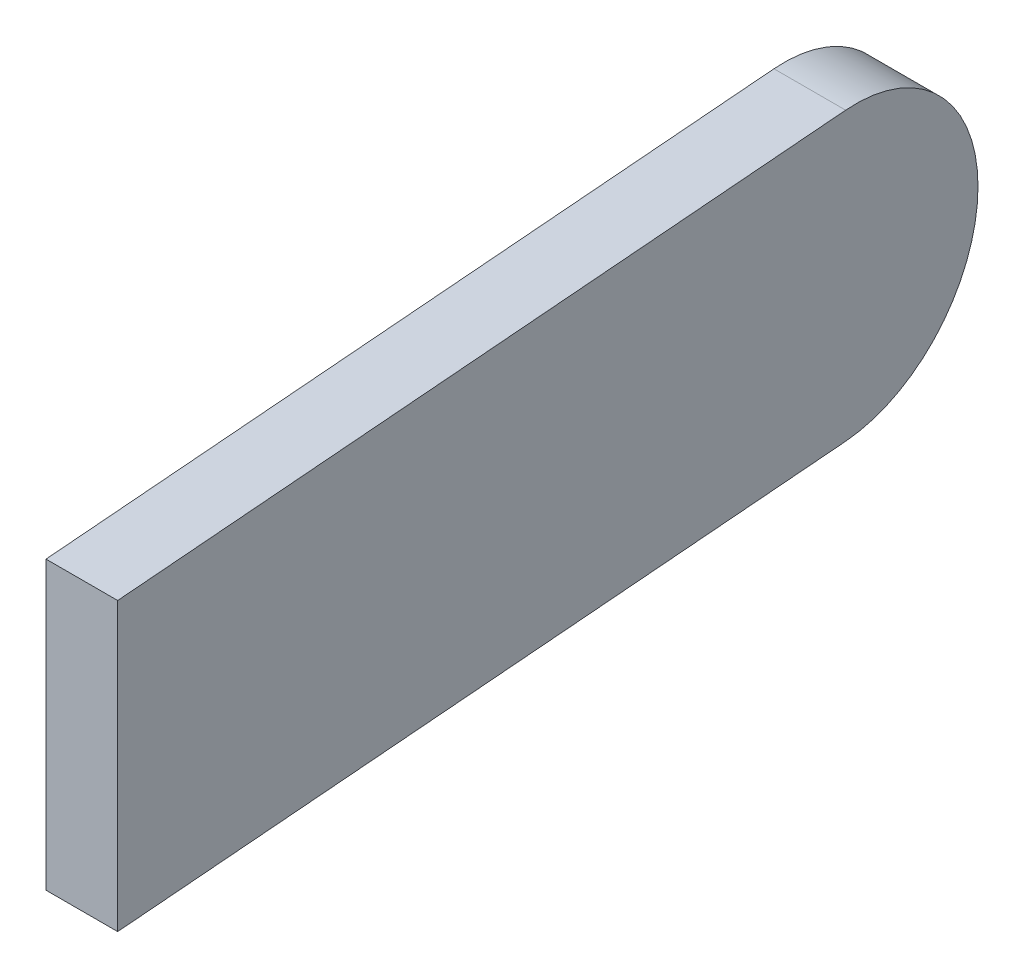
ISO-10303-21;
HEADER;
FILE_DESCRIPTION(('STEP AP214'),'2;1');
FILE_NAME('part.step','',(''),(''),'','','');
FILE_SCHEMA(('AUTOMOTIVE_DESIGN { 1 0 10303 214 1 1 1 1 }'));
ENDSEC;
DATA;
#1=APPLICATION_CONTEXT('core data for automotive mechanical design processes');
#2=APPLICATION_PROTOCOL_DEFINITION('international standard','automotive_design',2000,#1);
#3=PRODUCT_CONTEXT('',#1,'mechanical');
#4=PRODUCT('Part','Part','',(#3));
#5=PRODUCT_RELATED_PRODUCT_CATEGORY('part','',(#4));
#6=PRODUCT_DEFINITION_FORMATION('','',#4);
#7=PRODUCT_DEFINITION_CONTEXT('part definition',#1,'design');
#8=PRODUCT_DEFINITION('design','',#6,#7);
#9=PRODUCT_DEFINITION_SHAPE('','',#8);
#10=(LENGTH_UNIT() NAMED_UNIT(*) SI_UNIT(.MILLI.,.METRE.));
#11=(NAMED_UNIT(*) PLANE_ANGLE_UNIT() SI_UNIT($,.RADIAN.));
#12=(NAMED_UNIT(*) SI_UNIT($,.STERADIAN.) SOLID_ANGLE_UNIT());
#13=UNCERTAINTY_MEASURE_WITH_UNIT(LENGTH_MEASURE(1.E-05),#10,'distance_accuracy_value','');
#14=(GEOMETRIC_REPRESENTATION_CONTEXT(3) GLOBAL_UNCERTAINTY_ASSIGNED_CONTEXT((#13)) GLOBAL_UNIT_ASSIGNED_CONTEXT((#10,
#11,#12)) REPRESENTATION_CONTEXT('',''));
#15=CARTESIAN_POINT('',(0.,0.,0.));
#16=DIRECTION('',(0.,0.,1.));
#17=DIRECTION('',(1.,0.,0.));
#18=AXIS2_PLACEMENT_3D('',#15,#16,#17);
#19=CARTESIAN_POINT('',(-0.2,0.4,-1.3));
#20=DIRECTION('',(0.997054485501582,0.,-0.076696498884737));
#21=DIRECTION('',(-0.076696498884737,0.,-0.997054485501582));
#22=AXIS2_PLACEMENT_3D('',#19,#20,#21);
#23=PLANE('',#22);
#24=DIRECTION('',(0.076696498884737,0.,0.997054485501582));
#25=VECTOR('',#24,1.);
#26=CARTESIAN_POINT('',(-0.2,0.4,-1.3));
#27=LINE('',#26,#25);
#28=CARTESIAN_POINT('',(-0.169230769230769,0.4,-0.9));
#29=VERTEX_POINT('',#28);
#30=CARTESIAN_POINT('',(0.,0.4,1.3));
#31=VERTEX_POINT('',#30);
#32=EDGE_CURVE('E88',#29,#31,#27,.T.);
#33=ORIENTED_EDGE('',*,*,#32,.F.);
#34=CARTESIAN_POINT('',(-0.169230769230769,0.,-0.9));
#35=DIRECTION('',(0.997054485501582,0.,-0.076696498884737));
#36=DIRECTION('',(0.076696498884737,0.,0.997054485501582));
#37=AXIS2_PLACEMENT_3D('',#34,#35,#36);
#38=ELLIPSE('',#37,0.401181686474009,0.4);
#39=CARTESIAN_POINT('',(-0.2,0.,-1.3));
#40=VERTEX_POINT('',#39);
#41=EDGE_CURVE('E124',#29,#40,#38,.F.);
#42=ORIENTED_EDGE('',*,*,#41,.T.);
#43=CARTESIAN_POINT('',(-0.169230769230769,0.,-0.9));
#44=DIRECTION('',(0.997054485501582,0.,-0.076696498884737));
#45=DIRECTION('',(-0.076696498884737,0.,-0.997054485501582));
#46=AXIS2_PLACEMENT_3D('',#43,#44,#45);
#47=ELLIPSE('',#46,0.401181686474009,0.4);
#48=CARTESIAN_POINT('',(-0.169230769230769,-0.4,-0.9));
#49=VERTEX_POINT('',#48);
#50=EDGE_CURVE('E117',#40,#49,#47,.F.);
#51=ORIENTED_EDGE('',*,*,#50,.T.);
#52=DIRECTION('',(0.076696498884737,0.,0.997054485501582));
#53=VECTOR('',#52,1.);
#54=CARTESIAN_POINT('',(-0.2,-0.4,-1.3));
#55=LINE('',#54,#53);
#56=CARTESIAN_POINT('',(0.,-0.4,1.3));
#57=VERTEX_POINT('',#56);
#58=EDGE_CURVE('E111',#49,#57,#55,.T.);
#59=ORIENTED_EDGE('',*,*,#58,.T.);
#60=DIRECTION('',(0.,-1.,0.));
#61=VECTOR('',#60,1.);
#62=CARTESIAN_POINT('',(0.,0.4,1.3));
#63=LINE('',#62,#61);
#64=EDGE_CURVE('E104',#31,#57,#63,.T.);
#65=ORIENTED_EDGE('',*,*,#64,.F.);
#66=EDGE_LOOP('',(#33,#42,#51,#59,#65));
#67=FACE_BOUND('',#66,.T.);
#68=ADVANCED_FACE('F39',(#67),#23,.F.);
#69=CARTESIAN_POINT('',(0.,0.4,1.3));
#70=DIRECTION('',(0.,0.,-1.));
#71=DIRECTION('',(-1.,0.,0.));
#72=AXIS2_PLACEMENT_3D('',#69,#70,#71);
#73=PLANE('',#72);
#74=DIRECTION('',(1.,0.,0.));
#75=VECTOR('',#74,1.);
#76=CARTESIAN_POINT('',(0.,-0.4,1.3));
#77=LINE('',#76,#75);
#78=CARTESIAN_POINT('',(0.2,-0.4,1.3));
#79=VERTEX_POINT('',#78);
#80=EDGE_CURVE('E141',#57,#79,#77,.T.);
#81=ORIENTED_EDGE('',*,*,#80,.T.);
#82=DIRECTION('',(0.,-1.,0.));
#83=VECTOR('',#82,1.);
#84=CARTESIAN_POINT('',(0.2,0.4,1.3));
#85=LINE('',#84,#83);
#86=CARTESIAN_POINT('',(0.2,0.4,1.3));
#87=VERTEX_POINT('',#86);
#88=EDGE_CURVE('E106',#87,#79,#85,.T.);
#89=ORIENTED_EDGE('',*,*,#88,.F.);
#90=DIRECTION('',(1.,0.,0.));
#91=VECTOR('',#90,1.);
#92=CARTESIAN_POINT('',(0.,0.4,1.3));
#93=LINE('',#92,#91);
#94=EDGE_CURVE('E92',#31,#87,#93,.T.);
#95=ORIENTED_EDGE('',*,*,#94,.F.);
#96=ORIENTED_EDGE('',*,*,#64,.T.);
#97=EDGE_LOOP('',(#81,#89,#95,#96));
#98=FACE_BOUND('',#97,.T.);
#99=ADVANCED_FACE('F103',(#98),#73,.F.);
#100=CARTESIAN_POINT('',(0.,0.4,-1.3));
#101=DIRECTION('',(-0.997054485501582,0.,0.076696498884737));
#102=DIRECTION('',(0.076696498884737,0.,0.997054485501582));
#103=AXIS2_PLACEMENT_3D('',#100,#101,#102);
#104=PLANE('',#103);
#105=CARTESIAN_POINT('',(0.0307692307692308,0.,-0.9));
#106=DIRECTION('',(-0.997054485501582,0.,0.076696498884737));
#107=DIRECTION('',(-0.076696498884737,0.,-0.997054485501582));
#108=AXIS2_PLACEMENT_3D('',#105,#106,#107);
#109=ELLIPSE('',#108,0.401181686474009,0.4);
#110=CARTESIAN_POINT('',(0.0307692307692308,-0.4,-0.9));
#111=VERTEX_POINT('',#110);
#112=CARTESIAN_POINT('',(0.,0.,-1.3));
#113=VERTEX_POINT('',#112);
#114=EDGE_CURVE('E56',#111,#113,#109,.F.);
#115=ORIENTED_EDGE('',*,*,#114,.T.);
#116=CARTESIAN_POINT('',(0.0307692307692308,0.,-0.9));
#117=DIRECTION('',(-0.997054485501582,0.,0.076696498884737));
#118=DIRECTION('',(0.076696498884737,0.,0.997054485501582));
#119=AXIS2_PLACEMENT_3D('',#116,#117,#118);
#120=ELLIPSE('',#119,0.401181686474009,0.4);
#121=CARTESIAN_POINT('',(0.0307692307692308,0.4,-0.9));
#122=VERTEX_POINT('',#121);
#123=EDGE_CURVE('E49',#113,#122,#120,.F.);
#124=ORIENTED_EDGE('',*,*,#123,.T.);
#125=DIRECTION('',(-0.076696498884737,0.,-0.997054485501582));
#126=VECTOR('',#125,1.);
#127=CARTESIAN_POINT('',(0.,0.4,-1.3));
#128=LINE('',#127,#126);
#129=EDGE_CURVE('E109',#87,#122,#128,.T.);
#130=ORIENTED_EDGE('',*,*,#129,.F.);
#131=ORIENTED_EDGE('',*,*,#88,.T.);
#132=DIRECTION('',(-0.076696498884737,0.,-0.997054485501582));
#133=VECTOR('',#132,1.);
#134=CARTESIAN_POINT('',(0.,-0.4,-1.3));
#135=LINE('',#134,#133);
#136=EDGE_CURVE('E99',#79,#111,#135,.T.);
#137=ORIENTED_EDGE('',*,*,#136,.T.);
#138=EDGE_LOOP('',(#115,#124,#130,#131,#137));
#139=FACE_BOUND('',#138,.T.);
#140=ADVANCED_FACE('F131',(#139),#104,.F.);
#141=CARTESIAN_POINT('',(0.,0.4,0.));
#142=DIRECTION('',(0.,1.,0.));
#143=DIRECTION('',(0.,0.,1.));
#144=AXIS2_PLACEMENT_3D('',#141,#142,#143);
#145=PLANE('',#144);
#146=ORIENTED_EDGE('',*,*,#129,.T.);
#147=DIRECTION('',(-1.,0.,0.));
#148=VECTOR('',#147,1.);
#149=CARTESIAN_POINT('',(-0.2,0.4,-0.9));
#150=LINE('',#149,#148);
#151=EDGE_CURVE('E95',#122,#29,#150,.T.);
#152=ORIENTED_EDGE('',*,*,#151,.T.);
#153=ORIENTED_EDGE('',*,*,#32,.T.);
#154=ORIENTED_EDGE('',*,*,#94,.T.);
#155=EDGE_LOOP('',(#146,#152,#153,#154));
#156=FACE_BOUND('',#155,.T.);
#157=ADVANCED_FACE('F91',(#156),#145,.T.);
#158=CARTESIAN_POINT('',(0.,-0.4,0.));
#159=DIRECTION('',(0.,1.,0.));
#160=DIRECTION('',(0.,0.,1.));
#161=AXIS2_PLACEMENT_3D('',#158,#159,#160);
#162=PLANE('',#161);
#163=ORIENTED_EDGE('',*,*,#58,.F.);
#164=DIRECTION('',(-1.,0.,0.));
#165=VECTOR('',#164,1.);
#166=CARTESIAN_POINT('',(0.,-0.4,-0.9));
#167=LINE('',#166,#165);
#168=EDGE_CURVE('E11',#49,#111,#167,.F.);
#169=ORIENTED_EDGE('',*,*,#168,.T.);
#170=ORIENTED_EDGE('',*,*,#136,.F.);
#171=ORIENTED_EDGE('',*,*,#80,.F.);
#172=EDGE_LOOP('',(#163,#169,#170,#171));
#173=FACE_BOUND('',#172,.T.);
#174=ADVANCED_FACE('F146',(#173),#162,.F.);
#175=CARTESIAN_POINT('',(-0.2,0.,-0.9));
#176=DIRECTION('',(-1.,0.,0.));
#177=DIRECTION('',(0.,0.,1.));
#178=AXIS2_PLACEMENT_3D('',#175,#176,#177);
#179=CYLINDRICAL_SURFACE('',#178,0.4);
#180=DIRECTION('',(-1.,0.,0.));
#181=VECTOR('',#180,1.);
#182=CARTESIAN_POINT('',(-0.2,0.,-1.3));
#183=LINE('',#182,#181);
#184=EDGE_CURVE('E43',#113,#40,#183,.T.);
#185=ORIENTED_EDGE('',*,*,#184,.F.);
#186=ORIENTED_EDGE('',*,*,#114,.F.);
#187=ORIENTED_EDGE('',*,*,#168,.F.);
#188=ORIENTED_EDGE('',*,*,#50,.F.);
#189=EDGE_LOOP('',(#185,#186,#187,#188));
#190=FACE_BOUND('',#189,.T.);
#191=ADVANCED_FACE('F41',(#190),#179,.T.);
#192=CARTESIAN_POINT('',(0.,0.,-0.9));
#193=DIRECTION('',(1.,0.,0.));
#194=DIRECTION('',(0.,0.,-1.));
#195=AXIS2_PLACEMENT_3D('',#192,#193,#194);
#196=CYLINDRICAL_SURFACE('',#195,0.4);
#197=ORIENTED_EDGE('',*,*,#123,.F.);
#198=ORIENTED_EDGE('',*,*,#184,.T.);
#199=ORIENTED_EDGE('',*,*,#41,.F.);
#200=ORIENTED_EDGE('',*,*,#151,.F.);
#201=EDGE_LOOP('',(#197,#198,#199,#200));
#202=FACE_BOUND('',#201,.T.);
#203=ADVANCED_FACE('F136',(#202),#196,.T.);
#204=CLOSED_SHELL('',(#68,#99,#140,#157,#174,#191,#203));
#205=MANIFOLD_SOLID_BREP('B2',#204);
#206=ADVANCED_BREP_SHAPE_REPRESENTATION('',(#18,#205),#14);
#207=SHAPE_DEFINITION_REPRESENTATION(#9,#206);
ENDSEC;
END-ISO-10303-21;
